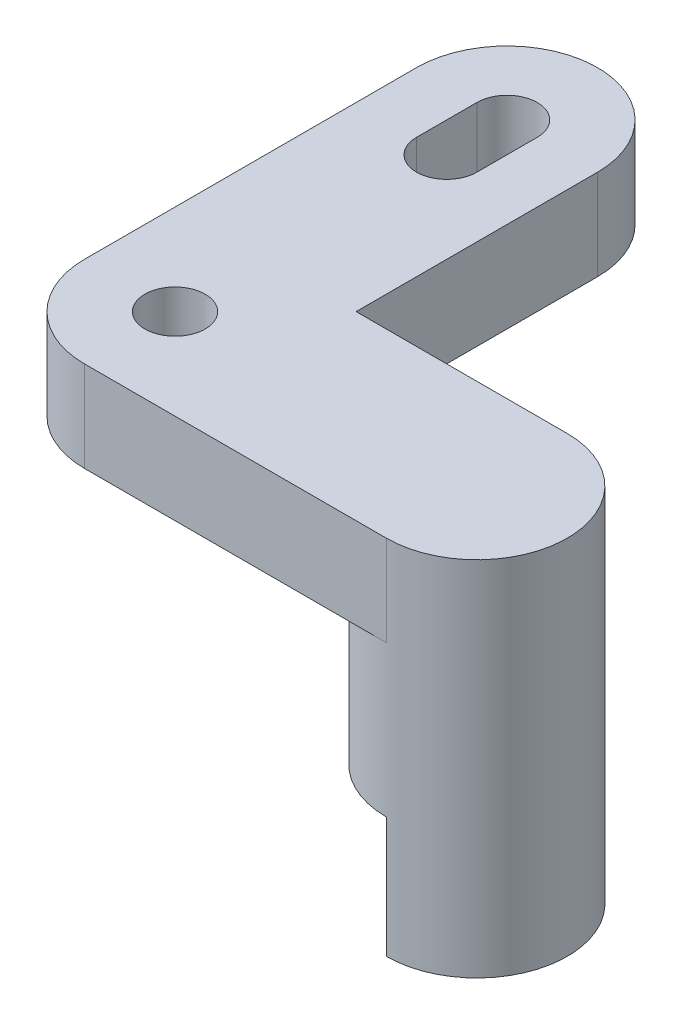
ISO-10303-21;
HEADER;
FILE_DESCRIPTION(('STEP AP214'),'2;1');
FILE_NAME('part.step','',(''),(''),'','','');
FILE_SCHEMA(('AUTOMOTIVE_DESIGN { 1 0 10303 214 1 1 1 1 }'));
ENDSEC;
DATA;
#1=APPLICATION_CONTEXT('core data for automotive mechanical design processes');
#2=APPLICATION_PROTOCOL_DEFINITION('international standard','automotive_design',2000,#1);
#3=PRODUCT_CONTEXT('',#1,'mechanical');
#4=PRODUCT('Part','Part','',(#3));
#5=PRODUCT_RELATED_PRODUCT_CATEGORY('part','',(#4));
#6=PRODUCT_DEFINITION_FORMATION('','',#4);
#7=PRODUCT_DEFINITION_CONTEXT('part definition',#1,'design');
#8=PRODUCT_DEFINITION('design','',#6,#7);
#9=PRODUCT_DEFINITION_SHAPE('','',#8);
#10=(LENGTH_UNIT() NAMED_UNIT(*) SI_UNIT(.MILLI.,.METRE.));
#11=(NAMED_UNIT(*) PLANE_ANGLE_UNIT() SI_UNIT($,.RADIAN.));
#12=(NAMED_UNIT(*) SI_UNIT($,.STERADIAN.) SOLID_ANGLE_UNIT());
#13=UNCERTAINTY_MEASURE_WITH_UNIT(LENGTH_MEASURE(1.E-05),#10,'distance_accuracy_value','');
#14=(GEOMETRIC_REPRESENTATION_CONTEXT(3) GLOBAL_UNCERTAINTY_ASSIGNED_CONTEXT((#13)) GLOBAL_UNIT_ASSIGNED_CONTEXT((#10,
#11,#12)) REPRESENTATION_CONTEXT('',''));
#15=CARTESIAN_POINT('',(0.,0.,0.));
#16=DIRECTION('',(0.,0.,1.));
#17=DIRECTION('',(1.,0.,0.));
#18=AXIS2_PLACEMENT_3D('',#15,#16,#17);
#19=CARTESIAN_POINT('',(5.,1.5,2.50000000000002));
#20=DIRECTION('',(0.,-1.,0.));
#21=DIRECTION('',(0.,0.,-1.));
#22=AXIS2_PLACEMENT_3D('',#19,#20,#21);
#23=CYLINDRICAL_SURFACE('',#22,1.5);
#24=CARTESIAN_POINT('',(5.,13.5,2.50000000000002));
#25=DIRECTION('',(0.,1.,0.));
#26=DIRECTION('',(0.,0.,1.));
#27=AXIS2_PLACEMENT_3D('',#24,#25,#26);
#28=CIRCLE('',#27,1.5);
#29=CARTESIAN_POINT('',(5.00000000000001,13.5,1.00000000000002));
#30=VERTEX_POINT('',#29);
#31=CARTESIAN_POINT('',(5.,13.5,4.00000000000002));
#32=VERTEX_POINT('',#31);
#33=EDGE_CURVE('E11',#30,#32,#28,.T.);
#34=ORIENTED_EDGE('',*,*,#33,.F.);
#35=DIRECTION('',(0.,-1.,0.));
#36=VECTOR('',#35,1.);
#37=CARTESIAN_POINT('',(5.00000000000001,15.,1.00000000000002));
#38=LINE('',#37,#36);
#39=CARTESIAN_POINT('',(5.00000000000001,15.,1.00000000000002));
#40=VERTEX_POINT('',#39);
#41=EDGE_CURVE('E215',#40,#30,#38,.T.);
#42=ORIENTED_EDGE('',*,*,#41,.F.);
#43=CARTESIAN_POINT('',(5.,15.,2.50000000000002));
#44=DIRECTION('',(0.,1.,0.));
#45=DIRECTION('',(0.,0.,-1.));
#46=AXIS2_PLACEMENT_3D('',#43,#44,#45);
#47=CIRCLE('',#46,1.5);
#48=CARTESIAN_POINT('',(5.,15.,4.00000000000002));
#49=VERTEX_POINT('',#48);
#50=EDGE_CURVE('E195',#49,#40,#47,.T.);
#51=ORIENTED_EDGE('',*,*,#50,.F.);
#52=DIRECTION('',(0.,-1.,0.));
#53=VECTOR('',#52,1.);
#54=CARTESIAN_POINT('',(5.,15.,4.00000000000002));
#55=LINE('',#54,#53);
#56=EDGE_CURVE('E217',#49,#32,#55,.T.);
#57=ORIENTED_EDGE('',*,*,#56,.T.);
#58=EDGE_LOOP('',(#34,#42,#51,#57));
#59=FACE_BOUND('',#58,.T.);
#60=CARTESIAN_POINT('',(5.,11.,2.50000000000002));
#61=DIRECTION('',(0.,-1.,0.));
#62=DIRECTION('',(0.,0.,-1.));
#63=AXIS2_PLACEMENT_3D('',#60,#61,#62);
#64=CIRCLE('',#63,1.5);
#65=CARTESIAN_POINT('',(5.,11.,4.00000000000002));
#66=VERTEX_POINT('',#65);
#67=CARTESIAN_POINT('',(5.00000000000001,11.,1.00000000000002));
#68=VERTEX_POINT('',#67);
#69=EDGE_CURVE('E130',#66,#68,#64,.T.);
#70=ORIENTED_EDGE('',*,*,#69,.F.);
#71=DIRECTION('',(0.,-1.,0.));
#72=VECTOR('',#71,1.);
#73=CARTESIAN_POINT('',(5.,11.,4.00000000000002));
#74=LINE('',#73,#72);
#75=CARTESIAN_POINT('',(5.,9.,4.00000000000002));
#76=VERTEX_POINT('',#75);
#77=EDGE_CURVE('E138',#66,#76,#74,.T.);
#78=ORIENTED_EDGE('',*,*,#77,.T.);
#79=CARTESIAN_POINT('',(5.,9.,2.50000000000002));
#80=DIRECTION('',(0.,-1.,0.));
#81=DIRECTION('',(0.,0.,-1.));
#82=AXIS2_PLACEMENT_3D('',#79,#80,#81);
#83=CIRCLE('',#82,1.5);
#84=CARTESIAN_POINT('',(5.00000000000001,9.,1.00000000000002));
#85=VERTEX_POINT('',#84);
#86=EDGE_CURVE('E38',#85,#76,#83,.T.);
#87=ORIENTED_EDGE('',*,*,#86,.F.);
#88=DIRECTION('',(0.,-1.,0.));
#89=VECTOR('',#88,1.);
#90=CARTESIAN_POINT('',(5.00000000000001,11.,1.00000000000002));
#91=LINE('',#90,#89);
#92=EDGE_CURVE('E50',#68,#85,#91,.T.);
#93=ORIENTED_EDGE('',*,*,#92,.F.);
#94=EDGE_LOOP('',(#70,#78,#87,#93));
#95=FACE_BOUND('',#94,.T.);
#96=ADVANCED_FACE('F35',(#59,#95),#23,.T.);
#97=CARTESIAN_POINT('',(5.,15.,2.50000000000002));
#98=DIRECTION('',(0.,-1.,0.));
#99=DIRECTION('',(0.,0.,-1.));
#100=AXIS2_PLACEMENT_3D('',#97,#98,#99);
#101=PLANE('',#100);
#102=CARTESIAN_POINT('',(0.,15.,2.49999999999999));
#103=DIRECTION('',(0.,1.,0.));
#104=DIRECTION('',(0.,0.,1.));
#105=AXIS2_PLACEMENT_3D('',#102,#103,#104);
#106=CIRCLE('',#105,0.5);
#107=CARTESIAN_POINT('',(0.,15.,2.99999999999999));
#108=VERTEX_POINT('',#107);
#109=EDGE_CURVE('E178',#108,#108,#106,.T.);
#110=ORIENTED_EDGE('',*,*,#109,.F.);
#111=EDGE_LOOP('',(#110));
#112=FACE_BOUND('',#111,.T.);
#113=DIRECTION('',(0.,0.,-1.));
#114=VECTOR('',#113,1.);
#115=CARTESIAN_POINT('',(1.5,15.,-2.5));
#116=LINE('',#115,#114);
#117=CARTESIAN_POINT('',(1.5,15.,1.00000000000001));
#118=VERTEX_POINT('',#117);
#119=CARTESIAN_POINT('',(1.5,15.,-3.));
#120=VERTEX_POINT('',#119);
#121=EDGE_CURVE('E184',#118,#120,#116,.T.);
#122=ORIENTED_EDGE('',*,*,#121,.T.);
#123=CARTESIAN_POINT('',(0.,15.,-3.));
#124=DIRECTION('',(0.,1.,0.));
#125=DIRECTION('',(0.,0.,1.));
#126=AXIS2_PLACEMENT_3D('',#123,#124,#125);
#127=CIRCLE('',#126,1.5);
#128=CARTESIAN_POINT('',(-1.5,15.,-3.));
#129=VERTEX_POINT('',#128);
#130=EDGE_CURVE('E186',#120,#129,#127,.T.);
#131=ORIENTED_EDGE('',*,*,#130,.T.);
#132=DIRECTION('',(0.,0.,1.));
#133=VECTOR('',#132,1.);
#134=CARTESIAN_POINT('',(-1.5,15.,-3.));
#135=LINE('',#134,#133);
#136=CARTESIAN_POINT('',(-1.5,15.,2.5));
#137=VERTEX_POINT('',#136);
#138=EDGE_CURVE('E189',#129,#137,#135,.T.);
#139=ORIENTED_EDGE('',*,*,#138,.T.);
#140=CARTESIAN_POINT('',(0.,15.,2.49999999999999));
#141=DIRECTION('',(0.,1.,0.));
#142=DIRECTION('',(0.,0.,-1.));
#143=AXIS2_PLACEMENT_3D('',#140,#141,#142);
#144=CIRCLE('',#143,1.50000000000001);
#145=CARTESIAN_POINT('',(0.,15.,4.));
#146=VERTEX_POINT('',#145);
#147=EDGE_CURVE('E191',#137,#146,#144,.T.);
#148=ORIENTED_EDGE('',*,*,#147,.T.);
#149=DIRECTION('',(1.,0.,0.));
#150=VECTOR('',#149,1.);
#151=CARTESIAN_POINT('',(5.,15.,4.00000000000002));
#152=LINE('',#151,#150);
#153=EDGE_CURVE('E193',#146,#49,#152,.T.);
#154=ORIENTED_EDGE('',*,*,#153,.T.);
#155=ORIENTED_EDGE('',*,*,#50,.T.);
#156=DIRECTION('',(-1.,0.,0.));
#157=VECTOR('',#156,1.);
#158=CARTESIAN_POINT('',(1.5,15.,1.00000000000001));
#159=LINE('',#158,#157);
#160=EDGE_CURVE('E197',#40,#118,#159,.T.);
#161=ORIENTED_EDGE('',*,*,#160,.T.);
#162=EDGE_LOOP('',(#122,#131,#139,#148,#154,#155,#161));
#163=FACE_BOUND('',#162,.T.);
#164=CARTESIAN_POINT('',(0.,15.,-3.));
#165=DIRECTION('',(0.,1.,0.));
#166=DIRECTION('',(0.,0.,1.));
#167=AXIS2_PLACEMENT_3D('',#164,#165,#166);
#168=CIRCLE('',#167,0.5);
#169=CARTESIAN_POINT('',(0.5,15.,-3.));
#170=VERTEX_POINT('',#169);
#171=CARTESIAN_POINT('',(-0.5,15.,-3.));
#172=VERTEX_POINT('',#171);
#173=EDGE_CURVE('E146',#170,#172,#168,.T.);
#174=ORIENTED_EDGE('',*,*,#173,.F.);
#175=DIRECTION('',(0.,0.,-1.));
#176=VECTOR('',#175,1.);
#177=CARTESIAN_POINT('',(0.5,15.,-3.));
#178=LINE('',#177,#176);
#179=CARTESIAN_POINT('',(0.5,15.,-2.));
#180=VERTEX_POINT('',#179);
#181=EDGE_CURVE('E154',#180,#170,#178,.T.);
#182=ORIENTED_EDGE('',*,*,#181,.F.);
#183=CARTESIAN_POINT('',(0.,15.,-2.));
#184=DIRECTION('',(0.,1.,0.));
#185=DIRECTION('',(0.,0.,1.));
#186=AXIS2_PLACEMENT_3D('',#183,#184,#185);
#187=CIRCLE('',#186,0.5);
#188=CARTESIAN_POINT('',(-0.5,15.,-2.));
#189=VERTEX_POINT('',#188);
#190=EDGE_CURVE('E151',#189,#180,#187,.T.);
#191=ORIENTED_EDGE('',*,*,#190,.F.);
#192=DIRECTION('',(0.,0.,1.));
#193=VECTOR('',#192,1.);
#194=CARTESIAN_POINT('',(-0.5,15.,-3.));
#195=LINE('',#194,#193);
#196=EDGE_CURVE('E148',#172,#189,#195,.T.);
#197=ORIENTED_EDGE('',*,*,#196,.F.);
#198=EDGE_LOOP('',(#174,#182,#191,#197));
#199=FACE_BOUND('',#198,.T.);
#200=ADVANCED_FACE('F253',(#112,#163,#199),#101,.F.);
#201=CARTESIAN_POINT('',(5.,13.5,2.50000000000002));
#202=DIRECTION('',(0.,-1.,0.));
#203=DIRECTION('',(0.,0.,-1.));
#204=AXIS2_PLACEMENT_3D('',#201,#202,#203);
#205=PLANE('',#204);
#206=DIRECTION('',(-1.,0.,0.));
#207=VECTOR('',#206,1.);
#208=CARTESIAN_POINT('',(1.5,13.5,1.00000000000001));
#209=LINE('',#208,#207);
#210=CARTESIAN_POINT('',(1.5,13.5,1.00000000000001));
#211=VERTEX_POINT('',#210);
#212=EDGE_CURVE('E187',#30,#211,#209,.T.);
#213=ORIENTED_EDGE('',*,*,#212,.F.);
#214=ORIENTED_EDGE('',*,*,#33,.T.);
#215=DIRECTION('',(1.,0.,0.));
#216=VECTOR('',#215,1.);
#217=CARTESIAN_POINT('',(5.,13.5,4.00000000000002));
#218=LINE('',#217,#216);
#219=CARTESIAN_POINT('',(0.,13.5,4.));
#220=VERTEX_POINT('',#219);
#221=EDGE_CURVE('E208',#220,#32,#218,.T.);
#222=ORIENTED_EDGE('',*,*,#221,.F.);
#223=CARTESIAN_POINT('',(0.,13.5,2.49999999999999));
#224=DIRECTION('',(0.,1.,0.));
#225=DIRECTION('',(0.,0.,-1.));
#226=AXIS2_PLACEMENT_3D('',#223,#224,#225);
#227=CIRCLE('',#226,1.50000000000001);
#228=CARTESIAN_POINT('',(-1.5,13.5,2.5));
#229=VERTEX_POINT('',#228);
#230=EDGE_CURVE('E206',#229,#220,#227,.T.);
#231=ORIENTED_EDGE('',*,*,#230,.F.);
#232=DIRECTION('',(0.,0.,1.));
#233=VECTOR('',#232,1.);
#234=CARTESIAN_POINT('',(-1.5,13.5,2.5));
#235=LINE('',#234,#233);
#236=CARTESIAN_POINT('',(-1.5,13.5,-3.));
#237=VERTEX_POINT('',#236);
#238=EDGE_CURVE('E204',#237,#229,#235,.T.);
#239=ORIENTED_EDGE('',*,*,#238,.F.);
#240=CARTESIAN_POINT('',(0.,13.5,-3.));
#241=DIRECTION('',(0.,1.,0.));
#242=DIRECTION('',(0.,0.,1.));
#243=AXIS2_PLACEMENT_3D('',#240,#241,#242);
#244=CIRCLE('',#243,1.5);
#245=CARTESIAN_POINT('',(1.5,13.5,-3.));
#246=VERTEX_POINT('',#245);
#247=EDGE_CURVE('E201',#246,#237,#244,.T.);
#248=ORIENTED_EDGE('',*,*,#247,.F.);
#249=DIRECTION('',(0.,0.,-1.));
#250=VECTOR('',#249,1.);
#251=CARTESIAN_POINT('',(1.5,13.5,-3.));
#252=LINE('',#251,#250);
#253=EDGE_CURVE('E181',#211,#246,#252,.T.);
#254=ORIENTED_EDGE('',*,*,#253,.F.);
#255=EDGE_LOOP('',(#213,#214,#222,#231,#239,#248,#254));
#256=FACE_BOUND('',#255,.T.);
#257=CARTESIAN_POINT('',(0.,13.5,2.49999999999999));
#258=DIRECTION('',(0.,1.,0.));
#259=DIRECTION('',(0.,0.,1.));
#260=AXIS2_PLACEMENT_3D('',#257,#258,#259);
#261=CIRCLE('',#260,0.5);
#262=CARTESIAN_POINT('',(0.,13.5,2.99999999999999));
#263=VERTEX_POINT('',#262);
#264=EDGE_CURVE('E177',#263,#263,#261,.T.);
#265=ORIENTED_EDGE('',*,*,#264,.T.);
#266=EDGE_LOOP('',(#265));
#267=FACE_BOUND('',#266,.T.);
#268=DIRECTION('',(0.,0.,-1.));
#269=VECTOR('',#268,1.);
#270=CARTESIAN_POINT('',(0.5,13.5,-3.));
#271=LINE('',#270,#269);
#272=CARTESIAN_POINT('',(0.5,13.5,-2.));
#273=VERTEX_POINT('',#272);
#274=CARTESIAN_POINT('',(0.5,13.5,-3.));
#275=VERTEX_POINT('',#274);
#276=EDGE_CURVE('E149',#273,#275,#271,.T.);
#277=ORIENTED_EDGE('',*,*,#276,.T.);
#278=CARTESIAN_POINT('',(0.,13.5,-3.));
#279=DIRECTION('',(0.,1.,0.));
#280=DIRECTION('',(0.,0.,1.));
#281=AXIS2_PLACEMENT_3D('',#278,#279,#280);
#282=CIRCLE('',#281,0.5);
#283=CARTESIAN_POINT('',(-0.5,13.5,-3.));
#284=VERTEX_POINT('',#283);
#285=EDGE_CURVE('E157',#275,#284,#282,.T.);
#286=ORIENTED_EDGE('',*,*,#285,.T.);
#287=DIRECTION('',(0.,0.,1.));
#288=VECTOR('',#287,1.);
#289=CARTESIAN_POINT('',(-0.5,13.5,-3.));
#290=LINE('',#289,#288);
#291=CARTESIAN_POINT('',(-0.5,13.5,-2.));
#292=VERTEX_POINT('',#291);
#293=EDGE_CURVE('E160',#284,#292,#290,.T.);
#294=ORIENTED_EDGE('',*,*,#293,.T.);
#295=CARTESIAN_POINT('',(0.,13.5,-2.));
#296=DIRECTION('',(0.,1.,0.));
#297=DIRECTION('',(0.,0.,1.));
#298=AXIS2_PLACEMENT_3D('',#295,#296,#297);
#299=CIRCLE('',#298,0.5);
#300=EDGE_CURVE('E163',#292,#273,#299,.T.);
#301=ORIENTED_EDGE('',*,*,#300,.T.);
#302=EDGE_LOOP('',(#277,#286,#294,#301));
#303=FACE_BOUND('',#302,.T.);
#304=ADVANCED_FACE('F239',(#256,#267,#303),#205,.T.);
#305=CARTESIAN_POINT('',(1.5,15.,-3.));
#306=DIRECTION('',(-1.,0.,0.));
#307=DIRECTION('',(0.,0.,1.));
#308=AXIS2_PLACEMENT_3D('',#305,#306,#307);
#309=PLANE('',#308);
#310=ORIENTED_EDGE('',*,*,#253,.T.);
#311=DIRECTION('',(0.,-1.,0.));
#312=VECTOR('',#311,1.);
#313=CARTESIAN_POINT('',(1.5,15.,-3.));
#314=LINE('',#313,#312);
#315=EDGE_CURVE('E43',#120,#246,#314,.T.);
#316=ORIENTED_EDGE('',*,*,#315,.F.);
#317=ORIENTED_EDGE('',*,*,#121,.F.);
#318=DIRECTION('',(0.,-1.,0.));
#319=VECTOR('',#318,1.);
#320=CARTESIAN_POINT('',(1.5,15.,1.00000000000001));
#321=LINE('',#320,#319);
#322=EDGE_CURVE('E199',#118,#211,#321,.T.);
#323=ORIENTED_EDGE('',*,*,#322,.T.);
#324=EDGE_LOOP('',(#310,#316,#317,#323));
#325=FACE_BOUND('',#324,.T.);
#326=ADVANCED_FACE('F258',(#325),#309,.F.);
#327=CARTESIAN_POINT('',(0.,15.,-3.));
#328=DIRECTION('',(0.,-1.,0.));
#329=DIRECTION('',(0.,0.,-1.));
#330=AXIS2_PLACEMENT_3D('',#327,#328,#329);
#331=CYLINDRICAL_SURFACE('',#330,1.5);
#332=ORIENTED_EDGE('',*,*,#247,.T.);
#333=DIRECTION('',(0.,-1.,0.));
#334=VECTOR('',#333,1.);
#335=CARTESIAN_POINT('',(-1.5,15.,-3.));
#336=LINE('',#335,#334);
#337=EDGE_CURVE('E225',#129,#237,#336,.T.);
#338=ORIENTED_EDGE('',*,*,#337,.F.);
#339=ORIENTED_EDGE('',*,*,#130,.F.);
#340=ORIENTED_EDGE('',*,*,#315,.T.);
#341=EDGE_LOOP('',(#332,#338,#339,#340));
#342=FACE_BOUND('',#341,.T.);
#343=ADVANCED_FACE('F233',(#342),#331,.T.);
#344=CARTESIAN_POINT('',(-1.5,15.,2.5));
#345=DIRECTION('',(1.,0.,0.));
#346=DIRECTION('',(0.,0.,-1.));
#347=AXIS2_PLACEMENT_3D('',#344,#345,#346);
#348=PLANE('',#347);
#349=ORIENTED_EDGE('',*,*,#238,.T.);
#350=DIRECTION('',(0.,-1.,0.));
#351=VECTOR('',#350,1.);
#352=CARTESIAN_POINT('',(-1.5,15.,2.5));
#353=LINE('',#352,#351);
#354=EDGE_CURVE('E222',#137,#229,#353,.T.);
#355=ORIENTED_EDGE('',*,*,#354,.F.);
#356=ORIENTED_EDGE('',*,*,#138,.F.);
#357=ORIENTED_EDGE('',*,*,#337,.T.);
#358=EDGE_LOOP('',(#349,#355,#356,#357));
#359=FACE_BOUND('',#358,.T.);
#360=ADVANCED_FACE('F245',(#359),#348,.F.);
#361=CARTESIAN_POINT('',(0.,15.,2.49999999999999));
#362=DIRECTION('',(0.,-1.,0.));
#363=DIRECTION('',(0.,0.,-1.));
#364=AXIS2_PLACEMENT_3D('',#361,#362,#363);
#365=CYLINDRICAL_SURFACE('',#364,1.50000000000001);
#366=ORIENTED_EDGE('',*,*,#230,.T.);
#367=DIRECTION('',(0.,-1.,0.));
#368=VECTOR('',#367,1.);
#369=CARTESIAN_POINT('',(0.,15.,4.));
#370=LINE('',#369,#368);
#371=EDGE_CURVE('E219',#146,#220,#370,.T.);
#372=ORIENTED_EDGE('',*,*,#371,.F.);
#373=ORIENTED_EDGE('',*,*,#147,.F.);
#374=ORIENTED_EDGE('',*,*,#354,.T.);
#375=EDGE_LOOP('',(#366,#372,#373,#374));
#376=FACE_BOUND('',#375,.T.);
#377=ADVANCED_FACE('F249',(#376),#365,.T.);
#378=CARTESIAN_POINT('',(5.,15.,4.00000000000002));
#379=DIRECTION('',(0.,0.,-1.));
#380=DIRECTION('',(-1.,0.,0.));
#381=AXIS2_PLACEMENT_3D('',#378,#379,#380);
#382=PLANE('',#381);
#383=ORIENTED_EDGE('',*,*,#221,.T.);
#384=ORIENTED_EDGE('',*,*,#56,.F.);
#385=ORIENTED_EDGE('',*,*,#153,.F.);
#386=ORIENTED_EDGE('',*,*,#371,.T.);
#387=EDGE_LOOP('',(#383,#384,#385,#386));
#388=FACE_BOUND('',#387,.T.);
#389=ADVANCED_FACE('F262',(#388),#382,.F.);
#390=CARTESIAN_POINT('',(1.5,15.,1.00000000000001));
#391=DIRECTION('',(0.,0.,1.));
#392=DIRECTION('',(1.,0.,0.));
#393=AXIS2_PLACEMENT_3D('',#390,#391,#392);
#394=PLANE('',#393);
#395=ORIENTED_EDGE('',*,*,#212,.T.);
#396=ORIENTED_EDGE('',*,*,#322,.F.);
#397=ORIENTED_EDGE('',*,*,#160,.F.);
#398=ORIENTED_EDGE('',*,*,#41,.T.);
#399=EDGE_LOOP('',(#395,#396,#397,#398));
#400=FACE_BOUND('',#399,.T.);
#401=ADVANCED_FACE('F260',(#400),#394,.F.);
#402=CARTESIAN_POINT('',(0.,15.,2.49999999999999));
#403=DIRECTION('',(0.,-1.,0.));
#404=DIRECTION('',(0.,0.,-1.));
#405=AXIS2_PLACEMENT_3D('',#402,#403,#404);
#406=CYLINDRICAL_SURFACE('',#405,0.5);
#407=ORIENTED_EDGE('',*,*,#109,.T.);
#408=EDGE_LOOP('',(#407));
#409=FACE_BOUND('',#408,.T.);
#410=ORIENTED_EDGE('',*,*,#264,.F.);
#411=EDGE_LOOP('',(#410));
#412=FACE_BOUND('',#411,.T.);
#413=ADVANCED_FACE('F278',(#409,#412),#406,.F.);
#414=CARTESIAN_POINT('',(0.,15.,-3.));
#415=DIRECTION('',(0.,-1.,0.));
#416=DIRECTION('',(0.,0.,-1.));
#417=AXIS2_PLACEMENT_3D('',#414,#415,#416);
#418=CYLINDRICAL_SURFACE('',#417,0.5);
#419=ORIENTED_EDGE('',*,*,#285,.F.);
#420=DIRECTION('',(0.,-1.,0.));
#421=VECTOR('',#420,1.);
#422=CARTESIAN_POINT('',(0.5,15.,-3.));
#423=LINE('',#422,#421);
#424=EDGE_CURVE('E156',#170,#275,#423,.T.);
#425=ORIENTED_EDGE('',*,*,#424,.F.);
#426=ORIENTED_EDGE('',*,*,#173,.T.);
#427=DIRECTION('',(0.,-1.,0.));
#428=VECTOR('',#427,1.);
#429=CARTESIAN_POINT('',(-0.5,15.,-3.));
#430=LINE('',#429,#428);
#431=EDGE_CURVE('E174',#172,#284,#430,.T.);
#432=ORIENTED_EDGE('',*,*,#431,.T.);
#433=EDGE_LOOP('',(#419,#425,#426,#432));
#434=FACE_BOUND('',#433,.T.);
#435=ADVANCED_FACE('F321',(#434),#418,.F.);
#436=CARTESIAN_POINT('',(-0.5,15.,-3.));
#437=DIRECTION('',(1.,0.,0.));
#438=DIRECTION('',(0.,0.,-1.));
#439=AXIS2_PLACEMENT_3D('',#436,#437,#438);
#440=PLANE('',#439);
#441=ORIENTED_EDGE('',*,*,#293,.F.);
#442=ORIENTED_EDGE('',*,*,#431,.F.);
#443=ORIENTED_EDGE('',*,*,#196,.T.);
#444=DIRECTION('',(0.,-1.,0.));
#445=VECTOR('',#444,1.);
#446=CARTESIAN_POINT('',(-0.5,15.,-2.));
#447=LINE('',#446,#445);
#448=EDGE_CURVE('E172',#189,#292,#447,.T.);
#449=ORIENTED_EDGE('',*,*,#448,.T.);
#450=EDGE_LOOP('',(#441,#442,#443,#449));
#451=FACE_BOUND('',#450,.T.);
#452=ADVANCED_FACE('F328',(#451),#440,.T.);
#453=CARTESIAN_POINT('',(0.,15.,-2.));
#454=DIRECTION('',(0.,-1.,0.));
#455=DIRECTION('',(0.,0.,-1.));
#456=AXIS2_PLACEMENT_3D('',#453,#454,#455);
#457=CYLINDRICAL_SURFACE('',#456,0.5);
#458=ORIENTED_EDGE('',*,*,#300,.F.);
#459=ORIENTED_EDGE('',*,*,#448,.F.);
#460=ORIENTED_EDGE('',*,*,#190,.T.);
#461=DIRECTION('',(0.,-1.,0.));
#462=VECTOR('',#461,1.);
#463=CARTESIAN_POINT('',(0.5,15.,-2.));
#464=LINE('',#463,#462);
#465=EDGE_CURVE('E170',#180,#273,#464,.T.);
#466=ORIENTED_EDGE('',*,*,#465,.T.);
#467=EDGE_LOOP('',(#458,#459,#460,#466));
#468=FACE_BOUND('',#467,.T.);
#469=ADVANCED_FACE('F335',(#468),#457,.F.);
#470=CARTESIAN_POINT('',(0.5,15.,-3.));
#471=DIRECTION('',(-1.,0.,0.));
#472=DIRECTION('',(0.,0.,1.));
#473=AXIS2_PLACEMENT_3D('',#470,#471,#472);
#474=PLANE('',#473);
#475=ORIENTED_EDGE('',*,*,#276,.F.);
#476=ORIENTED_EDGE('',*,*,#465,.F.);
#477=ORIENTED_EDGE('',*,*,#181,.T.);
#478=ORIENTED_EDGE('',*,*,#424,.T.);
#479=EDGE_LOOP('',(#475,#476,#477,#478));
#480=FACE_BOUND('',#479,.T.);
#481=ADVANCED_FACE('F343',(#480),#474,.T.);
#482=CARTESIAN_POINT('',(0.,9.,0.));
#483=DIRECTION('',(0.,-1.,0.));
#484=DIRECTION('',(0.,0.,-1.));
#485=AXIS2_PLACEMENT_3D('',#482,#483,#484);
#486=PLANE('',#485);
#487=DIRECTION('',(0.,0.,1.));
#488=VECTOR('',#487,1.);
#489=CARTESIAN_POINT('',(5.,9.,4.00000000000002));
#490=LINE('',#489,#488);
#491=EDGE_CURVE('E135',#85,#76,#490,.T.);
#492=ORIENTED_EDGE('',*,*,#491,.F.);
#493=ORIENTED_EDGE('',*,*,#86,.T.);
#494=EDGE_LOOP('',(#492,#493));
#495=FACE_BOUND('',#494,.T.);
#496=ADVANCED_FACE('F350',(#495),#486,.T.);
#497=CARTESIAN_POINT('',(5.,11.,4.00000000000002));
#498=DIRECTION('',(1.,0.,0.));
#499=DIRECTION('',(0.,0.,-1.));
#500=AXIS2_PLACEMENT_3D('',#497,#498,#499);
#501=PLANE('',#500);
#502=ORIENTED_EDGE('',*,*,#491,.T.);
#503=ORIENTED_EDGE('',*,*,#77,.F.);
#504=DIRECTION('',(0.,0.,1.));
#505=VECTOR('',#504,1.);
#506=CARTESIAN_POINT('',(5.,11.,4.00000000000002));
#507=LINE('',#506,#505);
#508=EDGE_CURVE('E132',#68,#66,#507,.T.);
#509=ORIENTED_EDGE('',*,*,#508,.F.);
#510=ORIENTED_EDGE('',*,*,#92,.T.);
#511=EDGE_LOOP('',(#502,#503,#509,#510));
#512=FACE_BOUND('',#511,.T.);
#513=ADVANCED_FACE('F137',(#512),#501,.F.);
#514=CARTESIAN_POINT('',(5.,11.,2.50000000000002));
#515=DIRECTION('',(0.,-1.,0.));
#516=DIRECTION('',(0.,0.,-1.));
#517=AXIS2_PLACEMENT_3D('',#514,#515,#516);
#518=PLANE('',#517);
#519=ORIENTED_EDGE('',*,*,#69,.T.);
#520=ORIENTED_EDGE('',*,*,#508,.T.);
#521=EDGE_LOOP('',(#519,#520));
#522=FACE_BOUND('',#521,.T.);
#523=ADVANCED_FACE('F131',(#522),#518,.T.);
#524=CLOSED_SHELL('',(#96,#200,#304,#326,#343,#360,#377,#389,#401,#413,#435,#452,#469,#481,#496,
#513,#523));
#525=MANIFOLD_SOLID_BREP('B2',#524);
#526=ADVANCED_BREP_SHAPE_REPRESENTATION('',(#18,#525),#14);
#527=SHAPE_DEFINITION_REPRESENTATION(#9,#526);
ENDSEC;
END-ISO-10303-21;
